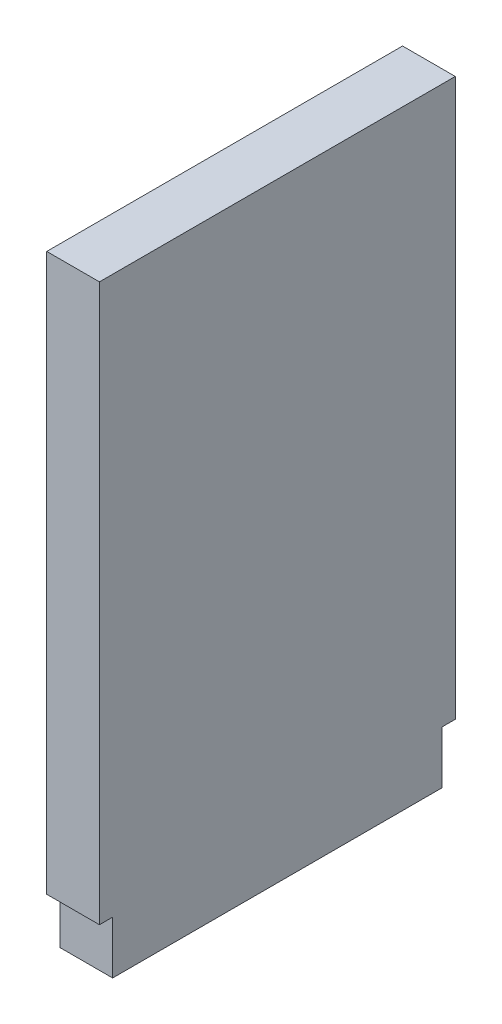
ISO-10303-21;
HEADER;
FILE_DESCRIPTION(('STEP AP214'),'2;1');
FILE_NAME('part.step','',(''),(''),'','','');
FILE_SCHEMA(('AUTOMOTIVE_DESIGN { 1 0 10303 214 1 1 1 1 }'));
ENDSEC;
DATA;
#1=APPLICATION_CONTEXT('core data for automotive mechanical design processes');
#2=APPLICATION_PROTOCOL_DEFINITION('international standard','automotive_design',2000,#1);
#3=PRODUCT_CONTEXT('',#1,'mechanical');
#4=PRODUCT('Part','Part','',(#3));
#5=PRODUCT_RELATED_PRODUCT_CATEGORY('part','',(#4));
#6=PRODUCT_DEFINITION_FORMATION('','',#4);
#7=PRODUCT_DEFINITION_CONTEXT('part definition',#1,'design');
#8=PRODUCT_DEFINITION('design','',#6,#7);
#9=PRODUCT_DEFINITION_SHAPE('','',#8);
#10=(LENGTH_UNIT() NAMED_UNIT(*) SI_UNIT(.MILLI.,.METRE.));
#11=(NAMED_UNIT(*) PLANE_ANGLE_UNIT() SI_UNIT($,.RADIAN.));
#12=(NAMED_UNIT(*) SI_UNIT($,.STERADIAN.) SOLID_ANGLE_UNIT());
#13=UNCERTAINTY_MEASURE_WITH_UNIT(LENGTH_MEASURE(1.E-05),#10,'distance_accuracy_value','');
#14=(GEOMETRIC_REPRESENTATION_CONTEXT(3) GLOBAL_UNCERTAINTY_ASSIGNED_CONTEXT((#13)) GLOBAL_UNIT_ASSIGNED_CONTEXT((#10,
#11,#12)) REPRESENTATION_CONTEXT('',''));
#15=CARTESIAN_POINT('',(0.,0.,0.));
#16=DIRECTION('',(0.,0.,1.));
#17=DIRECTION('',(1.,0.,0.));
#18=AXIS2_PLACEMENT_3D('',#15,#16,#17);
#19=CARTESIAN_POINT('',(0.8,0.,2.5));
#20=DIRECTION('',(0.,0.,-1.));
#21=DIRECTION('',(-1.,0.,0.));
#22=AXIS2_PLACEMENT_3D('',#19,#20,#21);
#23=PLANE('',#22);
#24=DIRECTION('',(0.,-1.,0.));
#25=VECTOR('',#24,1.);
#26=CARTESIAN_POINT('',(0.,0.,2.5));
#27=LINE('',#26,#25);
#28=CARTESIAN_POINT('',(0.,0.8,2.5));
#29=VERTEX_POINT('',#28);
#30=CARTESIAN_POINT('',(0.,0.,2.5));
#31=VERTEX_POINT('',#30);
#32=EDGE_CURVE('E144',#29,#31,#27,.T.);
#33=ORIENTED_EDGE('',*,*,#32,.T.);
#34=DIRECTION('',(-1.,0.,0.));
#35=VECTOR('',#34,1.);
#36=CARTESIAN_POINT('',(0.8,0.,2.5));
#37=LINE('',#36,#35);
#38=CARTESIAN_POINT('',(0.8,0.,2.5));
#39=VERTEX_POINT('',#38);
#40=EDGE_CURVE('E11',#39,#31,#37,.T.);
#41=ORIENTED_EDGE('',*,*,#40,.F.);
#42=DIRECTION('',(0.,-1.,0.));
#43=VECTOR('',#42,1.);
#44=CARTESIAN_POINT('',(0.8,0.,2.5));
#45=LINE('',#44,#43);
#46=CARTESIAN_POINT('',(0.8,0.8,2.5));
#47=VERTEX_POINT('',#46);
#48=EDGE_CURVE('E166',#47,#39,#45,.T.);
#49=ORIENTED_EDGE('',*,*,#48,.F.);
#50=DIRECTION('',(-1.,0.,0.));
#51=VECTOR('',#50,1.);
#52=CARTESIAN_POINT('',(0.8,0.8,2.5));
#53=LINE('',#52,#51);
#54=EDGE_CURVE('E140',#47,#29,#53,.T.);
#55=ORIENTED_EDGE('',*,*,#54,.T.);
#56=EDGE_LOOP('',(#33,#41,#49,#55));
#57=FACE_BOUND('',#56,.T.);
#58=ADVANCED_FACE('F43',(#57),#23,.F.);
#59=CARTESIAN_POINT('',(0.8,0.,2.5));
#60=DIRECTION('',(0.,1.,0.));
#61=DIRECTION('',(0.,0.,1.));
#62=AXIS2_PLACEMENT_3D('',#59,#60,#61);
#63=PLANE('',#62);
#64=DIRECTION('',(0.,0.,-1.));
#65=VECTOR('',#64,1.);
#66=CARTESIAN_POINT('',(0.,0.,2.5));
#67=LINE('',#66,#65);
#68=CARTESIAN_POINT('',(0.,0.,-2.5));
#69=VERTEX_POINT('',#68);
#70=EDGE_CURVE('E148',#31,#69,#67,.T.);
#71=ORIENTED_EDGE('',*,*,#70,.T.);
#72=DIRECTION('',(-1.,0.,0.));
#73=VECTOR('',#72,1.);
#74=CARTESIAN_POINT('',(0.8,0.,-2.5));
#75=LINE('',#74,#73);
#76=CARTESIAN_POINT('',(0.8,0.,-2.5));
#77=VERTEX_POINT('',#76);
#78=EDGE_CURVE('E52',#77,#69,#75,.T.);
#79=ORIENTED_EDGE('',*,*,#78,.F.);
#80=DIRECTION('',(0.,0.,-1.));
#81=VECTOR('',#80,1.);
#82=CARTESIAN_POINT('',(0.8,0.,2.5));
#83=LINE('',#82,#81);
#84=EDGE_CURVE('E103',#39,#77,#83,.T.);
#85=ORIENTED_EDGE('',*,*,#84,.F.);
#86=ORIENTED_EDGE('',*,*,#40,.T.);
#87=EDGE_LOOP('',(#71,#79,#85,#86));
#88=FACE_BOUND('',#87,.T.);
#89=ADVANCED_FACE('F212',(#88),#63,.F.);
#90=CARTESIAN_POINT('',(0.8,0.,-2.5));
#91=DIRECTION('',(0.,0.,1.));
#92=DIRECTION('',(1.,0.,0.));
#93=AXIS2_PLACEMENT_3D('',#90,#91,#92);
#94=PLANE('',#93);
#95=DIRECTION('',(0.,1.,0.));
#96=VECTOR('',#95,1.);
#97=CARTESIAN_POINT('',(0.,0.,-2.5));
#98=LINE('',#97,#96);
#99=CARTESIAN_POINT('',(0.,0.8,-2.5));
#100=VERTEX_POINT('',#99);
#101=EDGE_CURVE('E151',#69,#100,#98,.T.);
#102=ORIENTED_EDGE('',*,*,#101,.T.);
#103=DIRECTION('',(-1.,0.,0.));
#104=VECTOR('',#103,1.);
#105=CARTESIAN_POINT('',(0.8,0.8,-2.5));
#106=LINE('',#105,#104);
#107=CARTESIAN_POINT('',(0.8,0.8,-2.5));
#108=VERTEX_POINT('',#107);
#109=EDGE_CURVE('E177',#108,#100,#106,.T.);
#110=ORIENTED_EDGE('',*,*,#109,.F.);
#111=DIRECTION('',(0.,1.,0.));
#112=VECTOR('',#111,1.);
#113=CARTESIAN_POINT('',(0.8,0.,-2.5));
#114=LINE('',#113,#112);
#115=EDGE_CURVE('E187',#77,#108,#114,.T.);
#116=ORIENTED_EDGE('',*,*,#115,.F.);
#117=ORIENTED_EDGE('',*,*,#78,.T.);
#118=EDGE_LOOP('',(#102,#110,#116,#117));
#119=FACE_BOUND('',#118,.T.);
#120=ADVANCED_FACE('F185',(#119),#94,.F.);
#121=CARTESIAN_POINT('',(0.8,0.8,-2.5));
#122=DIRECTION('',(0.,1.,0.));
#123=DIRECTION('',(0.,0.,1.));
#124=AXIS2_PLACEMENT_3D('',#121,#122,#123);
#125=PLANE('',#124);
#126=DIRECTION('',(0.,0.,-1.));
#127=VECTOR('',#126,1.);
#128=CARTESIAN_POINT('',(0.,0.8,-2.5));
#129=LINE('',#128,#127);
#130=CARTESIAN_POINT('',(0.,0.8,-2.7));
#131=VERTEX_POINT('',#130);
#132=EDGE_CURVE('E154',#100,#131,#129,.T.);
#133=ORIENTED_EDGE('',*,*,#132,.T.);
#134=DIRECTION('',(-1.,0.,0.));
#135=VECTOR('',#134,1.);
#136=CARTESIAN_POINT('',(0.8,0.8,-2.7));
#137=LINE('',#136,#135);
#138=CARTESIAN_POINT('',(0.8,0.8,-2.7));
#139=VERTEX_POINT('',#138);
#140=EDGE_CURVE('E173',#139,#131,#137,.T.);
#141=ORIENTED_EDGE('',*,*,#140,.F.);
#142=DIRECTION('',(0.,0.,-1.));
#143=VECTOR('',#142,1.);
#144=CARTESIAN_POINT('',(0.8,0.8,-2.5));
#145=LINE('',#144,#143);
#146=EDGE_CURVE('E200',#108,#139,#145,.T.);
#147=ORIENTED_EDGE('',*,*,#146,.F.);
#148=ORIENTED_EDGE('',*,*,#109,.T.);
#149=EDGE_LOOP('',(#133,#141,#147,#148));
#150=FACE_BOUND('',#149,.T.);
#151=ADVANCED_FACE('F195',(#150),#125,.F.);
#152=CARTESIAN_POINT('',(0.8,0.8,-2.7));
#153=DIRECTION('',(0.,0.,1.));
#154=DIRECTION('',(1.,0.,0.));
#155=AXIS2_PLACEMENT_3D('',#152,#153,#154);
#156=PLANE('',#155);
#157=DIRECTION('',(0.,1.,0.));
#158=VECTOR('',#157,1.);
#159=CARTESIAN_POINT('',(0.,0.8,-2.7));
#160=LINE('',#159,#158);
#161=CARTESIAN_POINT('',(0.,9.25,-2.7));
#162=VERTEX_POINT('',#161);
#163=EDGE_CURVE('E157',#131,#162,#160,.T.);
#164=ORIENTED_EDGE('',*,*,#163,.T.);
#165=DIRECTION('',(-1.,0.,0.));
#166=VECTOR('',#165,1.);
#167=CARTESIAN_POINT('',(0.8,9.25,-2.7));
#168=LINE('',#167,#166);
#169=CARTESIAN_POINT('',(0.8,9.25,-2.7));
#170=VERTEX_POINT('',#169);
#171=EDGE_CURVE('E133',#170,#162,#168,.T.);
#172=ORIENTED_EDGE('',*,*,#171,.F.);
#173=DIRECTION('',(0.,1.,0.));
#174=VECTOR('',#173,1.);
#175=CARTESIAN_POINT('',(0.8,0.8,-2.7));
#176=LINE('',#175,#174);
#177=EDGE_CURVE('E122',#139,#170,#176,.T.);
#178=ORIENTED_EDGE('',*,*,#177,.F.);
#179=ORIENTED_EDGE('',*,*,#140,.T.);
#180=EDGE_LOOP('',(#164,#172,#178,#179));
#181=FACE_BOUND('',#180,.T.);
#182=ADVANCED_FACE('F198',(#181),#156,.F.);
#183=CARTESIAN_POINT('',(0.8,9.25,2.7));
#184=DIRECTION('',(0.,-1.,0.));
#185=DIRECTION('',(0.,0.,-1.));
#186=AXIS2_PLACEMENT_3D('',#183,#184,#185);
#187=PLANE('',#186);
#188=DIRECTION('',(0.,0.,1.));
#189=VECTOR('',#188,1.);
#190=CARTESIAN_POINT('',(0.,9.25,2.7));
#191=LINE('',#190,#189);
#192=CARTESIAN_POINT('',(0.,9.25,2.7));
#193=VERTEX_POINT('',#192);
#194=EDGE_CURVE('E131',#162,#193,#191,.T.);
#195=ORIENTED_EDGE('',*,*,#194,.T.);
#196=DIRECTION('',(-1.,0.,0.));
#197=VECTOR('',#196,1.);
#198=CARTESIAN_POINT('',(0.8,9.25,2.7));
#199=LINE('',#198,#197);
#200=CARTESIAN_POINT('',(0.8,9.25,2.7));
#201=VERTEX_POINT('',#200);
#202=EDGE_CURVE('E128',#201,#193,#199,.T.);
#203=ORIENTED_EDGE('',*,*,#202,.F.);
#204=DIRECTION('',(0.,0.,1.));
#205=VECTOR('',#204,1.);
#206=CARTESIAN_POINT('',(0.8,9.25,2.7));
#207=LINE('',#206,#205);
#208=EDGE_CURVE('E116',#170,#201,#207,.T.);
#209=ORIENTED_EDGE('',*,*,#208,.F.);
#210=ORIENTED_EDGE('',*,*,#171,.T.);
#211=EDGE_LOOP('',(#195,#203,#209,#210));
#212=FACE_BOUND('',#211,.T.);
#213=ADVANCED_FACE('F129',(#212),#187,.F.);
#214=CARTESIAN_POINT('',(0.8,0.8,2.7));
#215=DIRECTION('',(0.,0.,-1.));
#216=DIRECTION('',(-1.,0.,0.));
#217=AXIS2_PLACEMENT_3D('',#214,#215,#216);
#218=PLANE('',#217);
#219=DIRECTION('',(0.,-1.,0.));
#220=VECTOR('',#219,1.);
#221=CARTESIAN_POINT('',(0.,0.8,2.7));
#222=LINE('',#221,#220);
#223=CARTESIAN_POINT('',(0.,0.8,2.7));
#224=VERTEX_POINT('',#223);
#225=EDGE_CURVE('E89',#193,#224,#222,.T.);
#226=ORIENTED_EDGE('',*,*,#225,.T.);
#227=DIRECTION('',(-1.,0.,0.));
#228=VECTOR('',#227,1.);
#229=CARTESIAN_POINT('',(0.8,0.8,2.7));
#230=LINE('',#229,#228);
#231=CARTESIAN_POINT('',(0.8,0.8,2.7));
#232=VERTEX_POINT('',#231);
#233=EDGE_CURVE('E134',#232,#224,#230,.T.);
#234=ORIENTED_EDGE('',*,*,#233,.F.);
#235=DIRECTION('',(0.,-1.,0.));
#236=VECTOR('',#235,1.);
#237=CARTESIAN_POINT('',(0.8,0.8,2.7));
#238=LINE('',#237,#236);
#239=EDGE_CURVE('E120',#201,#232,#238,.T.);
#240=ORIENTED_EDGE('',*,*,#239,.F.);
#241=ORIENTED_EDGE('',*,*,#202,.T.);
#242=EDGE_LOOP('',(#226,#234,#240,#241));
#243=FACE_BOUND('',#242,.T.);
#244=ADVANCED_FACE('F136',(#243),#218,.F.);
#245=CARTESIAN_POINT('',(0.8,0.8,2.5));
#246=DIRECTION('',(0.,1.,0.));
#247=DIRECTION('',(0.,0.,1.));
#248=AXIS2_PLACEMENT_3D('',#245,#246,#247);
#249=PLANE('',#248);
#250=DIRECTION('',(0.,0.,-1.));
#251=VECTOR('',#250,1.);
#252=CARTESIAN_POINT('',(0.,0.8,2.5));
#253=LINE('',#252,#251);
#254=EDGE_CURVE('E95',#224,#29,#253,.T.);
#255=ORIENTED_EDGE('',*,*,#254,.T.);
#256=ORIENTED_EDGE('',*,*,#54,.F.);
#257=DIRECTION('',(0.,0.,-1.));
#258=VECTOR('',#257,1.);
#259=CARTESIAN_POINT('',(0.8,0.8,2.5));
#260=LINE('',#259,#258);
#261=EDGE_CURVE('E60',#232,#47,#260,.T.);
#262=ORIENTED_EDGE('',*,*,#261,.F.);
#263=ORIENTED_EDGE('',*,*,#233,.T.);
#264=EDGE_LOOP('',(#255,#256,#262,#263));
#265=FACE_BOUND('',#264,.T.);
#266=ADVANCED_FACE('F228',(#265),#249,.F.);
#267=CARTESIAN_POINT('',(0.8,0.,0.));
#268=DIRECTION('',(1.,0.,0.));
#269=DIRECTION('',(0.,0.,-1.));
#270=AXIS2_PLACEMENT_3D('',#267,#268,#269);
#271=PLANE('',#270);
#272=ORIENTED_EDGE('',*,*,#48,.T.);
#273=ORIENTED_EDGE('',*,*,#84,.T.);
#274=ORIENTED_EDGE('',*,*,#115,.T.);
#275=ORIENTED_EDGE('',*,*,#146,.T.);
#276=ORIENTED_EDGE('',*,*,#177,.T.);
#277=ORIENTED_EDGE('',*,*,#208,.T.);
#278=ORIENTED_EDGE('',*,*,#239,.T.);
#279=ORIENTED_EDGE('',*,*,#261,.T.);
#280=EDGE_LOOP('',(#272,#273,#274,#275,#276,#277,#278,#279));
#281=FACE_BOUND('',#280,.T.);
#282=ADVANCED_FACE('F118',(#281),#271,.T.);
#283=CARTESIAN_POINT('',(0.,0.,0.));
#284=DIRECTION('',(1.,0.,0.));
#285=DIRECTION('',(0.,0.,-1.));
#286=AXIS2_PLACEMENT_3D('',#283,#284,#285);
#287=PLANE('',#286);
#288=ORIENTED_EDGE('',*,*,#32,.F.);
#289=ORIENTED_EDGE('',*,*,#254,.F.);
#290=ORIENTED_EDGE('',*,*,#225,.F.);
#291=ORIENTED_EDGE('',*,*,#194,.F.);
#292=ORIENTED_EDGE('',*,*,#163,.F.);
#293=ORIENTED_EDGE('',*,*,#132,.F.);
#294=ORIENTED_EDGE('',*,*,#101,.F.);
#295=ORIENTED_EDGE('',*,*,#70,.F.);
#296=EDGE_LOOP('',(#288,#289,#290,#291,#292,#293,#294,#295));
#297=FACE_BOUND('',#296,.T.);
#298=ADVANCED_FACE('F191',(#297),#287,.F.);
#299=CLOSED_SHELL('',(#58,#89,#120,#151,#182,#213,#244,#266,#282,#298));
#300=MANIFOLD_SOLID_BREP('B2',#299);
#301=ADVANCED_BREP_SHAPE_REPRESENTATION('',(#18,#300),#14);
#302=SHAPE_DEFINITION_REPRESENTATION(#9,#301);
ENDSEC;
END-ISO-10303-21;
